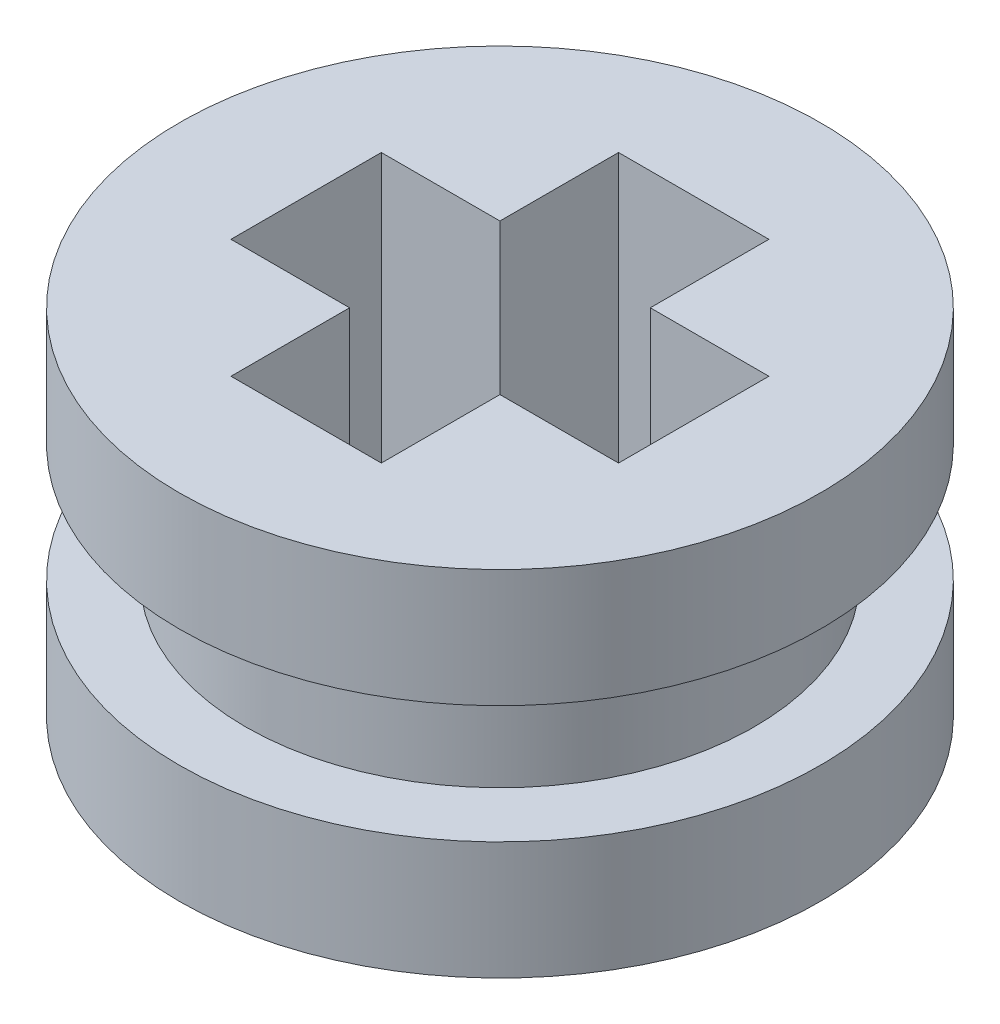
ISO-10303-21;
HEADER;
FILE_DESCRIPTION(('STEP AP214'),'2;1');
FILE_NAME('part.step','',(''),(''),'','','');
FILE_SCHEMA(('AUTOMOTIVE_DESIGN { 1 0 10303 214 1 1 1 1 }'));
ENDSEC;
DATA;
#1=APPLICATION_CONTEXT('core data for automotive mechanical design processes');
#2=APPLICATION_PROTOCOL_DEFINITION('international standard','automotive_design',2000,#1);
#3=PRODUCT_CONTEXT('',#1,'mechanical');
#4=PRODUCT('Part','Part','',(#3));
#5=PRODUCT_RELATED_PRODUCT_CATEGORY('part','',(#4));
#6=PRODUCT_DEFINITION_FORMATION('','',#4);
#7=PRODUCT_DEFINITION_CONTEXT('part definition',#1,'design');
#8=PRODUCT_DEFINITION('design','',#6,#7);
#9=PRODUCT_DEFINITION_SHAPE('','',#8);
#10=(LENGTH_UNIT() NAMED_UNIT(*) SI_UNIT(.MILLI.,.METRE.));
#11=(NAMED_UNIT(*) PLANE_ANGLE_UNIT() SI_UNIT($,.RADIAN.));
#12=(NAMED_UNIT(*) SI_UNIT($,.STERADIAN.) SOLID_ANGLE_UNIT());
#13=UNCERTAINTY_MEASURE_WITH_UNIT(LENGTH_MEASURE(1.E-05),#10,'distance_accuracy_value','');
#14=(GEOMETRIC_REPRESENTATION_CONTEXT(3) GLOBAL_UNCERTAINTY_ASSIGNED_CONTEXT((#13)) GLOBAL_UNIT_ASSIGNED_CONTEXT((#10,
#11,#12)) REPRESENTATION_CONTEXT('',''));
#15=CARTESIAN_POINT('',(0.,0.,0.));
#16=DIRECTION('',(0.,0.,1.));
#17=DIRECTION('',(1.,0.,0.));
#18=AXIS2_PLACEMENT_3D('',#15,#16,#17);
#19=CARTESIAN_POINT('',(0.,0.,0.));
#20=DIRECTION('',(0.,1.,0.));
#21=DIRECTION('',(0.,0.,1.));
#22=AXIS2_PLACEMENT_3D('',#19,#20,#21);
#23=PLANE('',#22);
#24=CARTESIAN_POINT('',(0.,0.,0.));
#25=DIRECTION('',(0.,1.,0.));
#26=DIRECTION('',(0.,0.,1.));
#27=AXIS2_PLACEMENT_3D('',#24,#25,#26);
#28=CIRCLE('',#27,3.625);
#29=CARTESIAN_POINT('',(0.,0.,3.625));
#30=VERTEX_POINT('',#29);
#31=EDGE_CURVE('E36',#30,#30,#28,.T.);
#32=ORIENTED_EDGE('',*,*,#31,.F.);
#33=EDGE_LOOP('',(#32));
#34=FACE_BOUND('',#33,.T.);
#35=DIRECTION('',(0.,0.,-1.));
#36=VECTOR('',#35,1.);
#37=CARTESIAN_POINT('',(-0.85,0.,0.));
#38=LINE('',#37,#36);
#39=CARTESIAN_POINT('',(-0.85,0.,-0.85));
#40=VERTEX_POINT('',#39);
#41=CARTESIAN_POINT('',(-0.85,0.,-2.19089023002066));
#42=VERTEX_POINT('',#41);
#43=EDGE_CURVE('E125',#40,#42,#38,.T.);
#44=ORIENTED_EDGE('',*,*,#43,.F.);
#45=DIRECTION('',(-1.,0.,0.));
#46=VECTOR('',#45,1.);
#47=CARTESIAN_POINT('',(0.,0.,-0.85));
#48=LINE('',#47,#46);
#49=CARTESIAN_POINT('',(-2.19089023002066,0.,-0.85));
#50=VERTEX_POINT('',#49);
#51=EDGE_CURVE('E131',#40,#50,#48,.T.);
#52=ORIENTED_EDGE('',*,*,#51,.T.);
#53=DIRECTION('',(0.,0.,-1.));
#54=VECTOR('',#53,1.);
#55=CARTESIAN_POINT('',(-2.19089023002066,0.,0.));
#56=LINE('',#55,#54);
#57=CARTESIAN_POINT('',(-2.19089023002066,0.,0.85));
#58=VERTEX_POINT('',#57);
#59=EDGE_CURVE('E135',#58,#50,#56,.T.);
#60=ORIENTED_EDGE('',*,*,#59,.F.);
#61=DIRECTION('',(-1.,0.,0.));
#62=VECTOR('',#61,1.);
#63=CARTESIAN_POINT('',(0.,0.,0.85));
#64=LINE('',#63,#62);
#65=CARTESIAN_POINT('',(-0.85,0.,0.85));
#66=VERTEX_POINT('',#65);
#67=EDGE_CURVE('E146',#66,#58,#64,.T.);
#68=ORIENTED_EDGE('',*,*,#67,.F.);
#69=DIRECTION('',(0.,0.,-1.));
#70=VECTOR('',#69,1.);
#71=CARTESIAN_POINT('',(-0.85,0.,0.));
#72=LINE('',#71,#70);
#73=CARTESIAN_POINT('',(-0.85,0.,2.19089023002066));
#74=VERTEX_POINT('',#73);
#75=EDGE_CURVE('E148',#74,#66,#72,.T.);
#76=ORIENTED_EDGE('',*,*,#75,.F.);
#77=DIRECTION('',(1.,0.,0.));
#78=VECTOR('',#77,1.);
#79=CARTESIAN_POINT('',(0.,0.,2.19089023002066));
#80=LINE('',#79,#78);
#81=CARTESIAN_POINT('',(0.85,0.,2.19089023002066));
#82=VERTEX_POINT('',#81);
#83=EDGE_CURVE('E150',#74,#82,#80,.T.);
#84=ORIENTED_EDGE('',*,*,#83,.T.);
#85=DIRECTION('',(0.,0.,-1.));
#86=VECTOR('',#85,1.);
#87=CARTESIAN_POINT('',(0.85,0.,0.));
#88=LINE('',#87,#86);
#89=CARTESIAN_POINT('',(0.85,0.,0.85));
#90=VERTEX_POINT('',#89);
#91=EDGE_CURVE('E153',#82,#90,#88,.T.);
#92=ORIENTED_EDGE('',*,*,#91,.T.);
#93=DIRECTION('',(-1.,0.,0.));
#94=VECTOR('',#93,1.);
#95=CARTESIAN_POINT('',(0.,0.,0.85));
#96=LINE('',#95,#94);
#97=CARTESIAN_POINT('',(2.19089023002066,0.,0.85));
#98=VERTEX_POINT('',#97);
#99=EDGE_CURVE('E156',#98,#90,#96,.T.);
#100=ORIENTED_EDGE('',*,*,#99,.F.);
#101=DIRECTION('',(0.,0.,-1.));
#102=VECTOR('',#101,1.);
#103=CARTESIAN_POINT('',(2.19089023002066,0.,0.));
#104=LINE('',#103,#102);
#105=CARTESIAN_POINT('',(2.19089023002066,0.,-0.85));
#106=VERTEX_POINT('',#105);
#107=EDGE_CURVE('E158',#98,#106,#104,.T.);
#108=ORIENTED_EDGE('',*,*,#107,.T.);
#109=DIRECTION('',(-1.,0.,0.));
#110=VECTOR('',#109,1.);
#111=CARTESIAN_POINT('',(0.,0.,-0.85));
#112=LINE('',#111,#110);
#113=CARTESIAN_POINT('',(0.85,0.,-0.85));
#114=VERTEX_POINT('',#113);
#115=EDGE_CURVE('E161',#106,#114,#112,.T.);
#116=ORIENTED_EDGE('',*,*,#115,.T.);
#117=DIRECTION('',(0.,0.,-1.));
#118=VECTOR('',#117,1.);
#119=CARTESIAN_POINT('',(0.85,0.,0.));
#120=LINE('',#119,#118);
#121=CARTESIAN_POINT('',(0.85,0.,-2.19089023002066));
#122=VERTEX_POINT('',#121);
#123=EDGE_CURVE('E164',#114,#122,#120,.T.);
#124=ORIENTED_EDGE('',*,*,#123,.T.);
#125=DIRECTION('',(1.,0.,0.));
#126=VECTOR('',#125,1.);
#127=CARTESIAN_POINT('',(0.,0.,-2.19089023002066));
#128=LINE('',#127,#126);
#129=EDGE_CURVE('E128',#42,#122,#128,.T.);
#130=ORIENTED_EDGE('',*,*,#129,.F.);
#131=EDGE_LOOP('',(#44,#52,#60,#68,#76,#84,#92,#100,#108,#116,#124,#130));
#132=FACE_BOUND('',#131,.T.);
#133=ADVANCED_FACE('F32',(#34,#132),#23,.F.);
#134=CARTESIAN_POINT('',(0.,3.99999999,0.));
#135=DIRECTION('',(0.,1.,0.));
#136=DIRECTION('',(0.,0.,1.));
#137=AXIS2_PLACEMENT_3D('',#134,#135,#136);
#138=PLANE('',#137);
#139=CARTESIAN_POINT('',(0.,3.99999999,0.));
#140=DIRECTION('',(0.,1.,0.));
#141=DIRECTION('',(0.,0.,1.));
#142=AXIS2_PLACEMENT_3D('',#139,#140,#141);
#143=CIRCLE('',#142,3.625);
#144=CARTESIAN_POINT('',(0.,3.99999999,3.625));
#145=VERTEX_POINT('',#144);
#146=EDGE_CURVE('E218',#145,#145,#143,.T.);
#147=ORIENTED_EDGE('',*,*,#146,.T.);
#148=EDGE_LOOP('',(#147));
#149=FACE_BOUND('',#148,.T.);
#150=DIRECTION('',(-1.,0.,0.));
#151=VECTOR('',#150,1.);
#152=CARTESIAN_POINT('',(0.,3.99999999,-0.85));
#153=LINE('',#152,#151);
#154=CARTESIAN_POINT('',(-0.85,3.99999999,-0.85));
#155=VERTEX_POINT('',#154);
#156=CARTESIAN_POINT('',(-2.19089023002066,3.99999999,-0.85));
#157=VERTEX_POINT('',#156);
#158=EDGE_CURVE('E168',#155,#157,#153,.T.);
#159=ORIENTED_EDGE('',*,*,#158,.F.);
#160=DIRECTION('',(0.,0.,-1.));
#161=VECTOR('',#160,1.);
#162=CARTESIAN_POINT('',(-0.85,3.99999999,0.));
#163=LINE('',#162,#161);
#164=CARTESIAN_POINT('',(-0.85,3.99999999,-2.19089023002066));
#165=VERTEX_POINT('',#164);
#166=EDGE_CURVE('E57',#155,#165,#163,.T.);
#167=ORIENTED_EDGE('',*,*,#166,.T.);
#168=DIRECTION('',(1.,0.,0.));
#169=VECTOR('',#168,1.);
#170=CARTESIAN_POINT('',(0.,3.99999999,-2.19089023002066));
#171=LINE('',#170,#169);
#172=CARTESIAN_POINT('',(0.85,3.99999999,-2.19089023002066));
#173=VERTEX_POINT('',#172);
#174=EDGE_CURVE('E139',#165,#173,#171,.T.);
#175=ORIENTED_EDGE('',*,*,#174,.T.);
#176=DIRECTION('',(0.,0.,-1.));
#177=VECTOR('',#176,1.);
#178=CARTESIAN_POINT('',(0.85,3.99999999,0.));
#179=LINE('',#178,#177);
#180=CARTESIAN_POINT('',(0.85,3.99999999,-0.85));
#181=VERTEX_POINT('',#180);
#182=EDGE_CURVE('E142',#181,#173,#179,.T.);
#183=ORIENTED_EDGE('',*,*,#182,.F.);
#184=DIRECTION('',(-1.,0.,0.));
#185=VECTOR('',#184,1.);
#186=CARTESIAN_POINT('',(0.,3.99999999,-0.85));
#187=LINE('',#186,#185);
#188=CARTESIAN_POINT('',(2.19089023002066,3.99999999,-0.85));
#189=VERTEX_POINT('',#188);
#190=EDGE_CURVE('E191',#189,#181,#187,.T.);
#191=ORIENTED_EDGE('',*,*,#190,.F.);
#192=DIRECTION('',(0.,0.,-1.));
#193=VECTOR('',#192,1.);
#194=CARTESIAN_POINT('',(2.19089023002066,3.99999999,0.));
#195=LINE('',#194,#193);
#196=CARTESIAN_POINT('',(2.19089023002066,3.99999999,0.85));
#197=VERTEX_POINT('',#196);
#198=EDGE_CURVE('E188',#197,#189,#195,.T.);
#199=ORIENTED_EDGE('',*,*,#198,.F.);
#200=DIRECTION('',(-1.,0.,0.));
#201=VECTOR('',#200,1.);
#202=CARTESIAN_POINT('',(0.,3.99999999,0.85));
#203=LINE('',#202,#201);
#204=CARTESIAN_POINT('',(0.85,3.99999999,0.85));
#205=VERTEX_POINT('',#204);
#206=EDGE_CURVE('E185',#197,#205,#203,.T.);
#207=ORIENTED_EDGE('',*,*,#206,.T.);
#208=DIRECTION('',(0.,0.,-1.));
#209=VECTOR('',#208,1.);
#210=CARTESIAN_POINT('',(0.85,3.99999999,0.));
#211=LINE('',#210,#209);
#212=CARTESIAN_POINT('',(0.85,3.99999999,2.19089023002066));
#213=VERTEX_POINT('',#212);
#214=EDGE_CURVE('E182',#213,#205,#211,.T.);
#215=ORIENTED_EDGE('',*,*,#214,.F.);
#216=DIRECTION('',(1.,0.,0.));
#217=VECTOR('',#216,1.);
#218=CARTESIAN_POINT('',(0.,3.99999999,2.19089023002066));
#219=LINE('',#218,#217);
#220=CARTESIAN_POINT('',(-0.85,3.99999999,2.19089023002066));
#221=VERTEX_POINT('',#220);
#222=EDGE_CURVE('E179',#221,#213,#219,.T.);
#223=ORIENTED_EDGE('',*,*,#222,.F.);
#224=DIRECTION('',(0.,0.,-1.));
#225=VECTOR('',#224,1.);
#226=CARTESIAN_POINT('',(-0.85,3.99999999,0.));
#227=LINE('',#226,#225);
#228=CARTESIAN_POINT('',(-0.85,3.99999999,0.85));
#229=VERTEX_POINT('',#228);
#230=EDGE_CURVE('E176',#221,#229,#227,.T.);
#231=ORIENTED_EDGE('',*,*,#230,.T.);
#232=DIRECTION('',(-1.,0.,0.));
#233=VECTOR('',#232,1.);
#234=CARTESIAN_POINT('',(0.,3.99999999,0.85));
#235=LINE('',#234,#233);
#236=CARTESIAN_POINT('',(-2.19089023002066,3.99999999,0.85));
#237=VERTEX_POINT('',#236);
#238=EDGE_CURVE('E173',#229,#237,#235,.T.);
#239=ORIENTED_EDGE('',*,*,#238,.T.);
#240=DIRECTION('',(0.,0.,-1.));
#241=VECTOR('',#240,1.);
#242=CARTESIAN_POINT('',(-2.19089023002066,3.99999999,0.));
#243=LINE('',#242,#241);
#244=EDGE_CURVE('E170',#237,#157,#243,.T.);
#245=ORIENTED_EDGE('',*,*,#244,.T.);
#246=EDGE_LOOP('',(#159,#167,#175,#183,#191,#199,#207,#215,#223,#231,#239,#245));
#247=FACE_BOUND('',#246,.T.);
#248=ADVANCED_FACE('F233',(#149,#247),#138,.T.);
#249=CARTESIAN_POINT('',(0.,1.33333333,0.));
#250=DIRECTION('',(0.,-1.,0.));
#251=DIRECTION('',(0.,0.,-1.));
#252=AXIS2_PLACEMENT_3D('',#249,#250,#251);
#253=CYLINDRICAL_SURFACE('',#252,3.625);
#254=CARTESIAN_POINT('',(0.,1.33333333,0.));
#255=DIRECTION('',(0.,1.,0.));
#256=DIRECTION('',(0.,0.,1.));
#257=AXIS2_PLACEMENT_3D('',#254,#255,#256);
#258=CIRCLE('',#257,3.625);
#259=CARTESIAN_POINT('',(0.,1.33333333,3.625));
#260=VERTEX_POINT('',#259);
#261=EDGE_CURVE('E41',#260,#260,#258,.T.);
#262=ORIENTED_EDGE('',*,*,#261,.F.);
#263=EDGE_LOOP('',(#262));
#264=FACE_BOUND('',#263,.T.);
#265=ORIENTED_EDGE('',*,*,#31,.T.);
#266=EDGE_LOOP('',(#265));
#267=FACE_BOUND('',#266,.T.);
#268=ADVANCED_FACE('F34',(#264,#267),#253,.T.);
#269=CARTESIAN_POINT('',(0.,1.33333333,0.));
#270=DIRECTION('',(0.,1.,0.));
#271=DIRECTION('',(0.,0.,1.));
#272=AXIS2_PLACEMENT_3D('',#269,#270,#271);
#273=PLANE('',#272);
#274=CARTESIAN_POINT('',(0.,1.33333333,0.));
#275=DIRECTION('',(0.,1.,0.));
#276=DIRECTION('',(0.,0.,1.));
#277=AXIS2_PLACEMENT_3D('',#274,#275,#276);
#278=CIRCLE('',#277,2.875);
#279=CARTESIAN_POINT('',(0.,1.33333333,2.875));
#280=VERTEX_POINT('',#279);
#281=EDGE_CURVE('E11',#280,#280,#278,.T.);
#282=ORIENTED_EDGE('',*,*,#281,.F.);
#283=EDGE_LOOP('',(#282));
#284=FACE_BOUND('',#283,.T.);
#285=ORIENTED_EDGE('',*,*,#261,.T.);
#286=EDGE_LOOP('',(#285));
#287=FACE_BOUND('',#286,.T.);
#288=ADVANCED_FACE('F240',(#284,#287),#273,.T.);
#289=CARTESIAN_POINT('',(0.,2.66666666,0.));
#290=DIRECTION('',(0.,-1.,0.));
#291=DIRECTION('',(0.,0.,-1.));
#292=AXIS2_PLACEMENT_3D('',#289,#290,#291);
#293=CYLINDRICAL_SURFACE('',#292,2.875);
#294=CARTESIAN_POINT('',(0.,2.66666666,0.));
#295=DIRECTION('',(0.,1.,0.));
#296=DIRECTION('',(0.,0.,1.));
#297=AXIS2_PLACEMENT_3D('',#294,#295,#296);
#298=CIRCLE('',#297,2.875);
#299=CARTESIAN_POINT('',(0.,2.66666666,2.875));
#300=VERTEX_POINT('',#299);
#301=EDGE_CURVE('E221',#300,#300,#298,.T.);
#302=ORIENTED_EDGE('',*,*,#301,.F.);
#303=EDGE_LOOP('',(#302));
#304=FACE_BOUND('',#303,.T.);
#305=ORIENTED_EDGE('',*,*,#281,.T.);
#306=EDGE_LOOP('',(#305));
#307=FACE_BOUND('',#306,.T.);
#308=ADVANCED_FACE('F243',(#304,#307),#293,.T.);
#309=CARTESIAN_POINT('',(0.,3.99999999,0.));
#310=DIRECTION('',(0.,-1.,0.));
#311=DIRECTION('',(0.,0.,-1.));
#312=AXIS2_PLACEMENT_3D('',#309,#310,#311);
#313=CYLINDRICAL_SURFACE('',#312,3.625);
#314=ORIENTED_EDGE('',*,*,#146,.F.);
#315=EDGE_LOOP('',(#314));
#316=FACE_BOUND('',#315,.T.);
#317=CARTESIAN_POINT('',(0.,2.66666666,0.));
#318=DIRECTION('',(0.,1.,0.));
#319=DIRECTION('',(0.,0.,1.));
#320=AXIS2_PLACEMENT_3D('',#317,#318,#319);
#321=CIRCLE('',#320,3.625);
#322=CARTESIAN_POINT('',(0.,2.66666666,3.625));
#323=VERTEX_POINT('',#322);
#324=EDGE_CURVE('E198',#323,#323,#321,.T.);
#325=ORIENTED_EDGE('',*,*,#324,.T.);
#326=EDGE_LOOP('',(#325));
#327=FACE_BOUND('',#326,.T.);
#328=ADVANCED_FACE('F247',(#316,#327),#313,.T.);
#329=CARTESIAN_POINT('',(0.,2.66666666,0.));
#330=DIRECTION('',(0.,1.,0.));
#331=DIRECTION('',(0.,0.,1.));
#332=AXIS2_PLACEMENT_3D('',#329,#330,#331);
#333=PLANE('',#332);
#334=ORIENTED_EDGE('',*,*,#301,.T.);
#335=EDGE_LOOP('',(#334));
#336=FACE_BOUND('',#335,.T.);
#337=ORIENTED_EDGE('',*,*,#324,.F.);
#338=EDGE_LOOP('',(#337));
#339=FACE_BOUND('',#338,.T.);
#340=ADVANCED_FACE('F251',(#336,#339),#333,.F.);
#341=CARTESIAN_POINT('',(-0.85,0.,0.));
#342=DIRECTION('',(1.,0.,0.));
#343=DIRECTION('',(0.,0.,-1.));
#344=AXIS2_PLACEMENT_3D('',#341,#342,#343);
#345=PLANE('',#344);
#346=ORIENTED_EDGE('',*,*,#166,.F.);
#347=DIRECTION('',(0.,1.,0.));
#348=VECTOR('',#347,1.);
#349=CARTESIAN_POINT('',(-0.85,0.,-0.85));
#350=LINE('',#349,#348);
#351=EDGE_CURVE('E122',#40,#155,#350,.T.);
#352=ORIENTED_EDGE('',*,*,#351,.F.);
#353=ORIENTED_EDGE('',*,*,#43,.T.);
#354=DIRECTION('',(0.,1.,0.));
#355=VECTOR('',#354,1.);
#356=CARTESIAN_POINT('',(-0.85,0.,-2.19089023002066));
#357=LINE('',#356,#355);
#358=EDGE_CURVE('E196',#42,#165,#357,.T.);
#359=ORIENTED_EDGE('',*,*,#358,.T.);
#360=EDGE_LOOP('',(#346,#352,#353,#359));
#361=FACE_BOUND('',#360,.T.);
#362=ADVANCED_FACE('F123',(#361),#345,.T.);
#363=CARTESIAN_POINT('',(0.,0.,-2.19089023002066));
#364=DIRECTION('',(0.,0.,1.));
#365=DIRECTION('',(1.,0.,0.));
#366=AXIS2_PLACEMENT_3D('',#363,#364,#365);
#367=PLANE('',#366);
#368=ORIENTED_EDGE('',*,*,#174,.F.);
#369=ORIENTED_EDGE('',*,*,#358,.F.);
#370=ORIENTED_EDGE('',*,*,#129,.T.);
#371=DIRECTION('',(0.,1.,0.));
#372=VECTOR('',#371,1.);
#373=CARTESIAN_POINT('',(0.85,0.,-2.19089023002066));
#374=LINE('',#373,#372);
#375=EDGE_CURVE('E199',#122,#173,#374,.T.);
#376=ORIENTED_EDGE('',*,*,#375,.T.);
#377=EDGE_LOOP('',(#368,#369,#370,#376));
#378=FACE_BOUND('',#377,.T.);
#379=ADVANCED_FACE('F258',(#378),#367,.T.);
#380=CARTESIAN_POINT('',(0.85,0.,0.));
#381=DIRECTION('',(1.,0.,0.));
#382=DIRECTION('',(0.,0.,-1.));
#383=AXIS2_PLACEMENT_3D('',#380,#381,#382);
#384=PLANE('',#383);
#385=ORIENTED_EDGE('',*,*,#182,.T.);
#386=ORIENTED_EDGE('',*,*,#375,.F.);
#387=ORIENTED_EDGE('',*,*,#123,.F.);
#388=DIRECTION('',(0.,1.,0.));
#389=VECTOR('',#388,1.);
#390=CARTESIAN_POINT('',(0.85,0.,-0.85));
#391=LINE('',#390,#389);
#392=EDGE_CURVE('E201',#114,#181,#391,.T.);
#393=ORIENTED_EDGE('',*,*,#392,.T.);
#394=EDGE_LOOP('',(#385,#386,#387,#393));
#395=FACE_BOUND('',#394,.T.);
#396=ADVANCED_FACE('F292',(#395),#384,.F.);
#397=CARTESIAN_POINT('',(0.,0.,-0.85));
#398=DIRECTION('',(0.,0.,-1.));
#399=DIRECTION('',(-1.,0.,0.));
#400=AXIS2_PLACEMENT_3D('',#397,#398,#399);
#401=PLANE('',#400);
#402=ORIENTED_EDGE('',*,*,#190,.T.);
#403=ORIENTED_EDGE('',*,*,#392,.F.);
#404=ORIENTED_EDGE('',*,*,#115,.F.);
#405=DIRECTION('',(0.,1.,0.));
#406=VECTOR('',#405,1.);
#407=CARTESIAN_POINT('',(2.19089023002066,0.,-0.85));
#408=LINE('',#407,#406);
#409=EDGE_CURVE('E203',#106,#189,#408,.T.);
#410=ORIENTED_EDGE('',*,*,#409,.T.);
#411=EDGE_LOOP('',(#402,#403,#404,#410));
#412=FACE_BOUND('',#411,.T.);
#413=ADVANCED_FACE('F288',(#412),#401,.F.);
#414=CARTESIAN_POINT('',(2.19089023002066,0.,0.));
#415=DIRECTION('',(1.,0.,0.));
#416=DIRECTION('',(0.,0.,-1.));
#417=AXIS2_PLACEMENT_3D('',#414,#415,#416);
#418=PLANE('',#417);
#419=ORIENTED_EDGE('',*,*,#198,.T.);
#420=ORIENTED_EDGE('',*,*,#409,.F.);
#421=ORIENTED_EDGE('',*,*,#107,.F.);
#422=DIRECTION('',(0.,1.,0.));
#423=VECTOR('',#422,1.);
#424=CARTESIAN_POINT('',(2.19089023002066,0.,0.85));
#425=LINE('',#424,#423);
#426=EDGE_CURVE('E205',#98,#197,#425,.T.);
#427=ORIENTED_EDGE('',*,*,#426,.T.);
#428=EDGE_LOOP('',(#419,#420,#421,#427));
#429=FACE_BOUND('',#428,.T.);
#430=ADVANCED_FACE('F284',(#429),#418,.F.);
#431=CARTESIAN_POINT('',(0.,0.,0.85));
#432=DIRECTION('',(0.,0.,-1.));
#433=DIRECTION('',(-1.,0.,0.));
#434=AXIS2_PLACEMENT_3D('',#431,#432,#433);
#435=PLANE('',#434);
#436=ORIENTED_EDGE('',*,*,#206,.F.);
#437=ORIENTED_EDGE('',*,*,#426,.F.);
#438=ORIENTED_EDGE('',*,*,#99,.T.);
#439=DIRECTION('',(0.,1.,0.));
#440=VECTOR('',#439,1.);
#441=CARTESIAN_POINT('',(0.85,0.,0.85));
#442=LINE('',#441,#440);
#443=EDGE_CURVE('E207',#90,#205,#442,.T.);
#444=ORIENTED_EDGE('',*,*,#443,.T.);
#445=EDGE_LOOP('',(#436,#437,#438,#444));
#446=FACE_BOUND('',#445,.T.);
#447=ADVANCED_FACE('F280',(#446),#435,.T.);
#448=CARTESIAN_POINT('',(0.85,0.,0.));
#449=DIRECTION('',(1.,0.,0.));
#450=DIRECTION('',(0.,0.,-1.));
#451=AXIS2_PLACEMENT_3D('',#448,#449,#450);
#452=PLANE('',#451);
#453=ORIENTED_EDGE('',*,*,#214,.T.);
#454=ORIENTED_EDGE('',*,*,#443,.F.);
#455=ORIENTED_EDGE('',*,*,#91,.F.);
#456=DIRECTION('',(0.,1.,0.));
#457=VECTOR('',#456,1.);
#458=CARTESIAN_POINT('',(0.85,0.,2.19089023002066));
#459=LINE('',#458,#457);
#460=EDGE_CURVE('E209',#82,#213,#459,.T.);
#461=ORIENTED_EDGE('',*,*,#460,.T.);
#462=EDGE_LOOP('',(#453,#454,#455,#461));
#463=FACE_BOUND('',#462,.T.);
#464=ADVANCED_FACE('F276',(#463),#452,.F.);
#465=CARTESIAN_POINT('',(0.,0.,2.19089023002066));
#466=DIRECTION('',(0.,0.,1.));
#467=DIRECTION('',(1.,0.,0.));
#468=AXIS2_PLACEMENT_3D('',#465,#466,#467);
#469=PLANE('',#468);
#470=ORIENTED_EDGE('',*,*,#222,.T.);
#471=ORIENTED_EDGE('',*,*,#460,.F.);
#472=ORIENTED_EDGE('',*,*,#83,.F.);
#473=DIRECTION('',(0.,1.,0.));
#474=VECTOR('',#473,1.);
#475=CARTESIAN_POINT('',(-0.85,0.,2.19089023002066));
#476=LINE('',#475,#474);
#477=EDGE_CURVE('E211',#74,#221,#476,.T.);
#478=ORIENTED_EDGE('',*,*,#477,.T.);
#479=EDGE_LOOP('',(#470,#471,#472,#478));
#480=FACE_BOUND('',#479,.T.);
#481=ADVANCED_FACE('F272',(#480),#469,.F.);
#482=CARTESIAN_POINT('',(-0.85,0.,0.));
#483=DIRECTION('',(1.,0.,0.));
#484=DIRECTION('',(0.,0.,-1.));
#485=AXIS2_PLACEMENT_3D('',#482,#483,#484);
#486=PLANE('',#485);
#487=ORIENTED_EDGE('',*,*,#230,.F.);
#488=ORIENTED_EDGE('',*,*,#477,.F.);
#489=ORIENTED_EDGE('',*,*,#75,.T.);
#490=DIRECTION('',(0.,1.,0.));
#491=VECTOR('',#490,1.);
#492=CARTESIAN_POINT('',(-0.85,0.,0.85));
#493=LINE('',#492,#491);
#494=EDGE_CURVE('E213',#66,#229,#493,.T.);
#495=ORIENTED_EDGE('',*,*,#494,.T.);
#496=EDGE_LOOP('',(#487,#488,#489,#495));
#497=FACE_BOUND('',#496,.T.);
#498=ADVANCED_FACE('F268',(#497),#486,.T.);
#499=CARTESIAN_POINT('',(0.,0.,0.85));
#500=DIRECTION('',(0.,0.,-1.));
#501=DIRECTION('',(-1.,0.,0.));
#502=AXIS2_PLACEMENT_3D('',#499,#500,#501);
#503=PLANE('',#502);
#504=ORIENTED_EDGE('',*,*,#238,.F.);
#505=ORIENTED_EDGE('',*,*,#494,.F.);
#506=ORIENTED_EDGE('',*,*,#67,.T.);
#507=DIRECTION('',(0.,1.,0.));
#508=VECTOR('',#507,1.);
#509=CARTESIAN_POINT('',(-2.19089023002066,0.,0.85));
#510=LINE('',#509,#508);
#511=EDGE_CURVE('E215',#58,#237,#510,.T.);
#512=ORIENTED_EDGE('',*,*,#511,.T.);
#513=EDGE_LOOP('',(#504,#505,#506,#512));
#514=FACE_BOUND('',#513,.T.);
#515=ADVANCED_FACE('F264',(#514),#503,.T.);
#516=CARTESIAN_POINT('',(-2.19089023002066,0.,0.));
#517=DIRECTION('',(1.,0.,0.));
#518=DIRECTION('',(0.,0.,-1.));
#519=AXIS2_PLACEMENT_3D('',#516,#517,#518);
#520=PLANE('',#519);
#521=ORIENTED_EDGE('',*,*,#244,.F.);
#522=ORIENTED_EDGE('',*,*,#511,.F.);
#523=ORIENTED_EDGE('',*,*,#59,.T.);
#524=DIRECTION('',(0.,1.,0.));
#525=VECTOR('',#524,1.);
#526=CARTESIAN_POINT('',(-2.19089023002066,0.,-0.85));
#527=LINE('',#526,#525);
#528=EDGE_CURVE('E49',#50,#157,#527,.T.);
#529=ORIENTED_EDGE('',*,*,#528,.T.);
#530=EDGE_LOOP('',(#521,#522,#523,#529));
#531=FACE_BOUND('',#530,.T.);
#532=ADVANCED_FACE('F261',(#531),#520,.T.);
#533=CARTESIAN_POINT('',(0.,0.,-0.85));
#534=DIRECTION('',(0.,0.,-1.));
#535=DIRECTION('',(-1.,0.,0.));
#536=AXIS2_PLACEMENT_3D('',#533,#534,#535);
#537=PLANE('',#536);
#538=ORIENTED_EDGE('',*,*,#158,.T.);
#539=ORIENTED_EDGE('',*,*,#528,.F.);
#540=ORIENTED_EDGE('',*,*,#51,.F.);
#541=ORIENTED_EDGE('',*,*,#351,.T.);
#542=EDGE_LOOP('',(#538,#539,#540,#541));
#543=FACE_BOUND('',#542,.T.);
#544=ADVANCED_FACE('F132',(#543),#537,.F.);
#545=CLOSED_SHELL('',(#133,#248,#268,#288,#308,#328,#340,#362,#379,#396,#413,#430,#447,#464,
#481,#498,#515,#532,#544));
#546=MANIFOLD_SOLID_BREP('B2',#545);
#547=ADVANCED_BREP_SHAPE_REPRESENTATION('',(#18,#546),#14);
#548=SHAPE_DEFINITION_REPRESENTATION(#9,#547);
ENDSEC;
END-ISO-10303-21;
